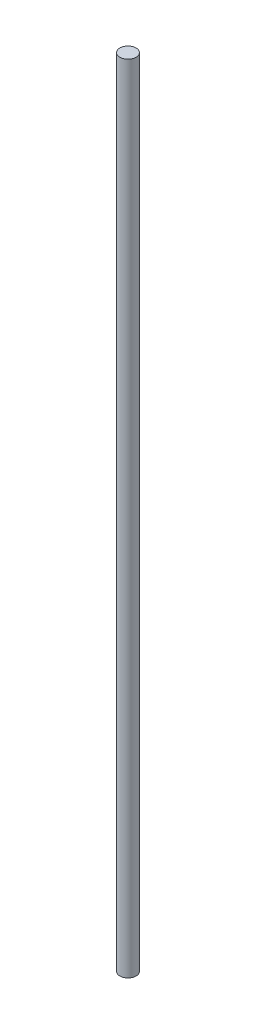
ISO-10303-21;
HEADER;
FILE_DESCRIPTION(('STEP AP214'),'2;1');
FILE_NAME('part.step','',(''),(''),'','','');
FILE_SCHEMA(('AUTOMOTIVE_DESIGN { 1 0 10303 214 1 1 1 1 }'));
ENDSEC;
DATA;
#1=APPLICATION_CONTEXT('core data for automotive mechanical design processes');
#2=APPLICATION_PROTOCOL_DEFINITION('international standard','automotive_design',2000,#1);
#3=PRODUCT_CONTEXT('',#1,'mechanical');
#4=PRODUCT('Part','Part','',(#3));
#5=PRODUCT_RELATED_PRODUCT_CATEGORY('part','',(#4));
#6=PRODUCT_DEFINITION_FORMATION('','',#4);
#7=PRODUCT_DEFINITION_CONTEXT('part definition',#1,'design');
#8=PRODUCT_DEFINITION('design','',#6,#7);
#9=PRODUCT_DEFINITION_SHAPE('','',#8);
#10=(LENGTH_UNIT() NAMED_UNIT(*) SI_UNIT(.MILLI.,.METRE.));
#11=(NAMED_UNIT(*) PLANE_ANGLE_UNIT() SI_UNIT($,.RADIAN.));
#12=(NAMED_UNIT(*) SI_UNIT($,.STERADIAN.) SOLID_ANGLE_UNIT());
#13=UNCERTAINTY_MEASURE_WITH_UNIT(LENGTH_MEASURE(1.E-05),#10,'distance_accuracy_value','');
#14=(GEOMETRIC_REPRESENTATION_CONTEXT(3) GLOBAL_UNCERTAINTY_ASSIGNED_CONTEXT((#13)) GLOBAL_UNIT_ASSIGNED_CONTEXT((#10,
#11,#12)) REPRESENTATION_CONTEXT('',''));
#15=CARTESIAN_POINT('',(0.,0.,0.));
#16=DIRECTION('',(0.,0.,1.));
#17=DIRECTION('',(1.,0.,0.));
#18=AXIS2_PLACEMENT_3D('',#15,#16,#17);
#19=CARTESIAN_POINT('',(0.,393.7,0.));
#20=DIRECTION('',(0.,-1.,0.));
#21=DIRECTION('',(0.,0.,-1.));
#22=AXIS2_PLACEMENT_3D('',#19,#20,#21);
#23=CYLINDRICAL_SURFACE('',#22,4.0005);
#24=CARTESIAN_POINT('',(0.,393.7,0.));
#25=DIRECTION('',(0.,1.,0.));
#26=DIRECTION('',(0.,0.,1.));
#27=AXIS2_PLACEMENT_3D('',#24,#25,#26);
#28=CIRCLE('',#27,4.0005);
#29=CARTESIAN_POINT('',(0.,393.7,4.0005));
#30=VERTEX_POINT('',#29);
#31=EDGE_CURVE('E10',#30,#30,#28,.T.);
#32=ORIENTED_EDGE('',*,*,#31,.F.);
#33=EDGE_LOOP('',(#32));
#34=FACE_BOUND('',#33,.T.);
#35=CARTESIAN_POINT('',(0.,0.,0.));
#36=DIRECTION('',(0.,1.,0.));
#37=DIRECTION('',(0.,0.,1.));
#38=AXIS2_PLACEMENT_3D('',#35,#36,#37);
#39=CIRCLE('',#38,4.0005);
#40=CARTESIAN_POINT('',(0.,0.,4.0005));
#41=VERTEX_POINT('',#40);
#42=EDGE_CURVE('E40',#41,#41,#39,.T.);
#43=ORIENTED_EDGE('',*,*,#42,.T.);
#44=EDGE_LOOP('',(#43));
#45=FACE_BOUND('',#44,.T.);
#46=ADVANCED_FACE('F37',(#34,#45),#23,.T.);
#47=CARTESIAN_POINT('',(0.,393.7,0.));
#48=DIRECTION('',(0.,1.,0.));
#49=DIRECTION('',(0.,0.,1.));
#50=AXIS2_PLACEMENT_3D('',#47,#48,#49);
#51=PLANE('',#50);
#52=ORIENTED_EDGE('',*,*,#31,.T.);
#53=EDGE_LOOP('',(#52));
#54=FACE_BOUND('',#53,.T.);
#55=ADVANCED_FACE('F54',(#54),#51,.T.);
#56=CARTESIAN_POINT('',(0.,0.,0.));
#57=DIRECTION('',(0.,1.,0.));
#58=DIRECTION('',(0.,0.,1.));
#59=AXIS2_PLACEMENT_3D('',#56,#57,#58);
#60=PLANE('',#59);
#61=ORIENTED_EDGE('',*,*,#42,.F.);
#62=EDGE_LOOP('',(#61));
#63=FACE_BOUND('',#62,.T.);
#64=ADVANCED_FACE('F52',(#63),#60,.F.);
#65=CLOSED_SHELL('',(#46,#55,#64));
#66=MANIFOLD_SOLID_BREP('B2',#65);
#67=ADVANCED_BREP_SHAPE_REPRESENTATION('',(#18,#66),#14);
#68=SHAPE_DEFINITION_REPRESENTATION(#9,#67);
ENDSEC;
END-ISO-10303-21;
